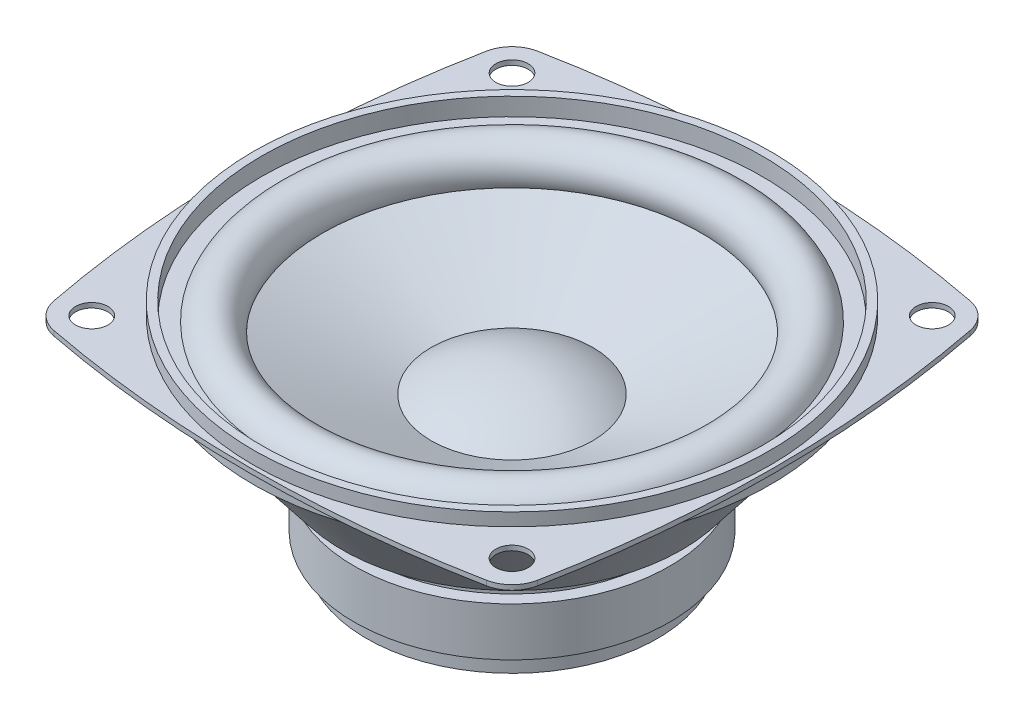
ISO-10303-21;
HEADER;
FILE_DESCRIPTION(('STEP AP214'),'2;1');
FILE_NAME('part.step','',(''),(''),'','','');
FILE_SCHEMA(('AUTOMOTIVE_DESIGN { 1 0 10303 214 1 1 1 1 }'));
ENDSEC;
DATA;
#1=APPLICATION_CONTEXT('core data for automotive mechanical design processes');
#2=APPLICATION_PROTOCOL_DEFINITION('international standard','automotive_design',2000,#1);
#3=PRODUCT_CONTEXT('',#1,'mechanical');
#4=PRODUCT('Part','Part','',(#3));
#5=PRODUCT_RELATED_PRODUCT_CATEGORY('part','',(#4));
#6=PRODUCT_DEFINITION_FORMATION('','',#4);
#7=PRODUCT_DEFINITION_CONTEXT('part definition',#1,'design');
#8=PRODUCT_DEFINITION('design','',#6,#7);
#9=PRODUCT_DEFINITION_SHAPE('','',#8);
#10=(LENGTH_UNIT() NAMED_UNIT(*) SI_UNIT(.MILLI.,.METRE.));
#11=(NAMED_UNIT(*) PLANE_ANGLE_UNIT() SI_UNIT($,.RADIAN.));
#12=(NAMED_UNIT(*) SI_UNIT($,.STERADIAN.) SOLID_ANGLE_UNIT());
#13=UNCERTAINTY_MEASURE_WITH_UNIT(LENGTH_MEASURE(1.E-05),#10,'distance_accuracy_value','');
#14=(GEOMETRIC_REPRESENTATION_CONTEXT(3) GLOBAL_UNCERTAINTY_ASSIGNED_CONTEXT((#13)) GLOBAL_UNIT_ASSIGNED_CONTEXT((#10,
#11,#12)) REPRESENTATION_CONTEXT('',''));
#15=CARTESIAN_POINT('',(0.,0.,0.));
#16=DIRECTION('',(0.,0.,1.));
#17=DIRECTION('',(1.,0.,0.));
#18=AXIS2_PLACEMENT_3D('',#15,#16,#17);
#19=CARTESIAN_POINT('',(12.5,-6.07928572530609,-29.7384862787188));
#20=DIRECTION('',(0.,0.61630826165811,0.787505001007586));
#21=DIRECTION('',(0.,-0.787505001007586,0.61630826165811));
#22=AXIS2_PLACEMENT_3D('',#19,#20,#21);
#23=PLANE('',#22);
#24=DIRECTION('',(-1.,0.,0.));
#25=VECTOR('',#24,1.);
#26=CARTESIAN_POINT('',(-8.5,-8.39726579362784,-27.9244149209017));
#27=LINE('',#26,#25);
#28=CARTESIAN_POINT('',(-12.5,-8.39726579362784,-27.9244149209017));
#29=VERTEX_POINT('',#28);
#30=CARTESIAN_POINT('',(-8.5,-8.39726579362784,-27.9244149209017));
#31=VERTEX_POINT('',#30);
#32=EDGE_CURVE('E108',#29,#31,#27,.F.);
#33=ORIENTED_EDGE('',*,*,#32,.F.);
#34=DIRECTION('',(0.,0.787505001007586,-0.61630826165811));
#35=VECTOR('',#34,1.);
#36=CARTESIAN_POINT('',(-12.5,-6.07928572530609,-29.7384862787188));
#37=LINE('',#36,#35);
#38=CARTESIAN_POINT('',(-12.5,-6.07928572530609,-29.7384862787188));
#39=VERTEX_POINT('',#38);
#40=EDGE_CURVE('E136',#29,#39,#37,.T.);
#41=ORIENTED_EDGE('',*,*,#40,.T.);
#42=DIRECTION('',(-1.,0.,0.));
#43=VECTOR('',#42,1.);
#44=CARTESIAN_POINT('',(12.5,-6.07928572530609,-29.7384862787188));
#45=LINE('',#44,#43);
#46=CARTESIAN_POINT('',(12.5,-6.07928572530609,-29.7384862787188));
#47=VERTEX_POINT('',#46);
#48=EDGE_CURVE('E162',#47,#39,#45,.T.);
#49=ORIENTED_EDGE('',*,*,#48,.F.);
#50=DIRECTION('',(0.,0.787505001007586,-0.61630826165811));
#51=VECTOR('',#50,1.);
#52=CARTESIAN_POINT('',(12.5,-6.07928572530609,-29.7384862787188));
#53=LINE('',#52,#51);
#54=CARTESIAN_POINT('',(12.5,-8.39726579362784,-27.9244149209017));
#55=VERTEX_POINT('',#54);
#56=EDGE_CURVE('E141',#55,#47,#53,.T.);
#57=ORIENTED_EDGE('',*,*,#56,.F.);
#58=DIRECTION('',(1.,0.,0.));
#59=VECTOR('',#58,1.);
#60=CARTESIAN_POINT('',(8.5,-8.39726579362784,-27.9244149209017));
#61=LINE('',#60,#59);
#62=CARTESIAN_POINT('',(8.5,-8.39726579362784,-27.9244149209017));
#63=VERTEX_POINT('',#62);
#64=EDGE_CURVE('E67',#55,#63,#61,.F.);
#65=ORIENTED_EDGE('',*,*,#64,.T.);
#66=DIRECTION('',(0.,0.787505001007586,-0.61630826165811));
#67=VECTOR('',#66,1.);
#68=CARTESIAN_POINT('',(8.5,-6.07928572530609,-29.7384862787188));
#69=LINE('',#68,#67);
#70=CARTESIAN_POINT('',(8.5,-10.061345665045,-26.6220915432709));
#71=VERTEX_POINT('',#70);
#72=EDGE_CURVE('E167',#71,#63,#69,.T.);
#73=ORIENTED_EDGE('',*,*,#72,.F.);
#74=DIRECTION('',(1.,0.,0.));
#75=VECTOR('',#74,1.);
#76=CARTESIAN_POINT('',(8.5,-10.061345665045,-26.6220915432709));
#77=LINE('',#76,#75);
#78=CARTESIAN_POINT('',(12.5,-10.061345665045,-26.6220915432709));
#79=VERTEX_POINT('',#78);
#80=EDGE_CURVE('E133',#71,#79,#77,.T.);
#81=ORIENTED_EDGE('',*,*,#80,.T.);
#82=CARTESIAN_POINT('',(12.5,-12.3793257333668,-24.8080201854539));
#83=VERTEX_POINT('',#82);
#84=EDGE_CURVE('E137',#83,#79,#53,.T.);
#85=ORIENTED_EDGE('',*,*,#84,.F.);
#86=DIRECTION('',(-1.,0.,0.));
#87=VECTOR('',#86,1.);
#88=CARTESIAN_POINT('',(12.5,-12.3793257333668,-24.8080201854539));
#89=LINE('',#88,#87);
#90=CARTESIAN_POINT('',(-12.5,-12.3793257333668,-24.8080201854539));
#91=VERTEX_POINT('',#90);
#92=EDGE_CURVE('E147',#83,#91,#89,.T.);
#93=ORIENTED_EDGE('',*,*,#92,.T.);
#94=CARTESIAN_POINT('',(-12.5,-10.061345665045,-26.6220915432709));
#95=VERTEX_POINT('',#94);
#96=EDGE_CURVE('E124',#91,#95,#37,.T.);
#97=ORIENTED_EDGE('',*,*,#96,.T.);
#98=DIRECTION('',(-1.,0.,0.));
#99=VECTOR('',#98,1.);
#100=CARTESIAN_POINT('',(-8.5,-10.061345665045,-26.6220915432709));
#101=LINE('',#100,#99);
#102=CARTESIAN_POINT('',(-8.5,-10.061345665045,-26.6220915432709));
#103=VERTEX_POINT('',#102);
#104=EDGE_CURVE('E59',#103,#95,#101,.T.);
#105=ORIENTED_EDGE('',*,*,#104,.F.);
#106=DIRECTION('',(0.,-0.787505001007586,0.61630826165811));
#107=VECTOR('',#106,1.);
#108=CARTESIAN_POINT('',(-8.5,-6.07928572530609,-29.7384862787188));
#109=LINE('',#108,#107);
#110=EDGE_CURVE('E12',#31,#103,#109,.T.);
#111=ORIENTED_EDGE('',*,*,#110,.F.);
#112=EDGE_LOOP('',(#33,#41,#49,#57,#65,#73,#81,#85,#93,#97,#105,#111));
#113=FACE_BOUND('',#112,.T.);
#114=ADVANCED_FACE('F45',(#113),#23,.F.);
#115=CARTESIAN_POINT('',(-12.5,0.,0.));
#116=DIRECTION('',(-1.,0.,0.));
#117=DIRECTION('',(0.,0.,1.));
#118=AXIS2_PLACEMENT_3D('',#115,#116,#117);
#119=PLANE('',#118);
#120=ORIENTED_EDGE('',*,*,#40,.F.);
#121=CARTESIAN_POINT('',(-12.5,-9.22930572933643,-27.2732532320863));
#122=DIRECTION('',(-1.,0.,0.));
#123=DIRECTION('',(0.,0.,1.));
#124=AXIS2_PLACEMENT_3D('',#121,#122,#123);
#125=CIRCLE('',#124,1.05655193890074);
#126=EDGE_CURVE('E52',#29,#95,#125,.F.);
#127=ORIENTED_EDGE('',*,*,#126,.T.);
#128=ORIENTED_EDGE('',*,*,#96,.F.);
#129=DIRECTION('',(0.,-0.61630826165811,-0.787505001007586));
#130=VECTOR('',#129,1.);
#131=CARTESIAN_POINT('',(-12.5,-12.3793257333668,-24.8080201854539));
#132=LINE('',#131,#130);
#133=CARTESIAN_POINT('',(-12.5,-11.1467092100506,-23.2330101834387));
#134=VERTEX_POINT('',#133);
#135=EDGE_CURVE('E153',#134,#91,#132,.T.);
#136=ORIENTED_EDGE('',*,*,#135,.F.);
#137=DIRECTION('',(0.,-0.787505001007586,0.616308261658111));
#138=VECTOR('',#137,1.);
#139=CARTESIAN_POINT('',(-12.5,-4.84666920198987,-28.1634762767036));
#140=LINE('',#139,#138);
#141=CARTESIAN_POINT('',(-12.5,-4.84666920198987,-28.1634762767036));
#142=VERTEX_POINT('',#141);
#143=EDGE_CURVE('E151',#142,#134,#140,.T.);
#144=ORIENTED_EDGE('',*,*,#143,.F.);
#145=DIRECTION('',(0.,0.616308261658111,0.787505001007585));
#146=VECTOR('',#145,1.);
#147=CARTESIAN_POINT('',(-12.5,-6.07928572530609,-29.7384862787188));
#148=LINE('',#147,#146);
#149=EDGE_CURVE('E149',#39,#142,#148,.T.);
#150=ORIENTED_EDGE('',*,*,#149,.F.);
#151=EDGE_LOOP('',(#120,#127,#128,#136,#144,#150));
#152=FACE_BOUND('',#151,.T.);
#153=ADVANCED_FACE('F169',(#152),#119,.T.);
#154=CARTESIAN_POINT('',(12.5,-6.07928572530609,-29.7384862787188));
#155=DIRECTION('',(0.,-0.787505001007586,0.616308261658111));
#156=DIRECTION('',(0.,-0.616308261658111,-0.787505001007585));
#157=AXIS2_PLACEMENT_3D('',#154,#155,#156);
#158=PLANE('',#157);
#159=ORIENTED_EDGE('',*,*,#149,.T.);
#160=DIRECTION('',(-1.,0.,0.));
#161=VECTOR('',#160,1.);
#162=CARTESIAN_POINT('',(12.5,-4.84666920198987,-28.1634762767036));
#163=LINE('',#162,#161);
#164=CARTESIAN_POINT('',(12.5,-4.84666920198987,-28.1634762767036));
#165=VERTEX_POINT('',#164);
#166=EDGE_CURVE('E159',#165,#142,#163,.T.);
#167=ORIENTED_EDGE('',*,*,#166,.F.);
#168=DIRECTION('',(0.,0.616308261658111,0.787505001007585));
#169=VECTOR('',#168,1.);
#170=CARTESIAN_POINT('',(12.5,-6.07928572530609,-29.7384862787188));
#171=LINE('',#170,#169);
#172=EDGE_CURVE('E140',#47,#165,#171,.T.);
#173=ORIENTED_EDGE('',*,*,#172,.F.);
#174=ORIENTED_EDGE('',*,*,#48,.T.);
#175=EDGE_LOOP('',(#159,#167,#173,#174));
#176=FACE_BOUND('',#175,.T.);
#177=ADVANCED_FACE('F177',(#176),#158,.F.);
#178=CARTESIAN_POINT('',(12.5,-4.84666920198987,-28.1634762767036));
#179=DIRECTION('',(0.,-0.61630826165811,-0.787505001007586));
#180=DIRECTION('',(0.,0.787505001007586,-0.616308261658111));
#181=AXIS2_PLACEMENT_3D('',#178,#179,#180);
#182=PLANE('',#181);
#183=ORIENTED_EDGE('',*,*,#143,.T.);
#184=DIRECTION('',(-1.,0.,0.));
#185=VECTOR('',#184,1.);
#186=CARTESIAN_POINT('',(12.5,-11.1467092100506,-23.2330101834387));
#187=LINE('',#186,#185);
#188=CARTESIAN_POINT('',(12.5,-11.1467092100506,-23.2330101834387));
#189=VERTEX_POINT('',#188);
#190=EDGE_CURVE('E156',#189,#134,#187,.T.);
#191=ORIENTED_EDGE('',*,*,#190,.F.);
#192=DIRECTION('',(0.,-0.787505001007586,0.616308261658111));
#193=VECTOR('',#192,1.);
#194=CARTESIAN_POINT('',(12.5,-4.84666920198987,-28.1634762767036));
#195=LINE('',#194,#193);
#196=EDGE_CURVE('E143',#165,#189,#195,.T.);
#197=ORIENTED_EDGE('',*,*,#196,.F.);
#198=ORIENTED_EDGE('',*,*,#166,.T.);
#199=EDGE_LOOP('',(#183,#191,#197,#198));
#200=FACE_BOUND('',#199,.T.);
#201=ADVANCED_FACE('F209',(#200),#182,.F.);
#202=CARTESIAN_POINT('',(12.5,-12.3793257333668,-24.8080201854539));
#203=DIRECTION('',(0.,0.787505001007587,-0.61630826165811));
#204=DIRECTION('',(0.,0.61630826165811,0.787505001007587));
#205=AXIS2_PLACEMENT_3D('',#202,#203,#204);
#206=PLANE('',#205);
#207=ORIENTED_EDGE('',*,*,#135,.T.);
#208=ORIENTED_EDGE('',*,*,#92,.F.);
#209=DIRECTION('',(0.,-0.61630826165811,-0.787505001007586));
#210=VECTOR('',#209,1.);
#211=CARTESIAN_POINT('',(12.5,-12.3793257333668,-24.8080201854539));
#212=LINE('',#211,#210);
#213=EDGE_CURVE('E145',#189,#83,#212,.T.);
#214=ORIENTED_EDGE('',*,*,#213,.F.);
#215=ORIENTED_EDGE('',*,*,#190,.T.);
#216=EDGE_LOOP('',(#207,#208,#214,#215));
#217=FACE_BOUND('',#216,.T.);
#218=ADVANCED_FACE('F198',(#217),#206,.F.);
#219=CARTESIAN_POINT('',(12.5,0.,0.));
#220=DIRECTION('',(-1.,0.,0.));
#221=DIRECTION('',(0.,0.,1.));
#222=AXIS2_PLACEMENT_3D('',#219,#220,#221);
#223=PLANE('',#222);
#224=ORIENTED_EDGE('',*,*,#84,.T.);
#225=CARTESIAN_POINT('',(12.5,-9.22930572933643,-27.2732532320863));
#226=DIRECTION('',(-1.,0.,0.));
#227=DIRECTION('',(0.,0.,1.));
#228=AXIS2_PLACEMENT_3D('',#225,#226,#227);
#229=CIRCLE('',#228,1.05655193890074);
#230=EDGE_CURVE('E165',#79,#55,#229,.T.);
#231=ORIENTED_EDGE('',*,*,#230,.T.);
#232=ORIENTED_EDGE('',*,*,#56,.T.);
#233=ORIENTED_EDGE('',*,*,#172,.T.);
#234=ORIENTED_EDGE('',*,*,#196,.T.);
#235=ORIENTED_EDGE('',*,*,#213,.T.);
#236=EDGE_LOOP('',(#224,#231,#232,#233,#234,#235));
#237=FACE_BOUND('',#236,.T.);
#238=ADVANCED_FACE('F181',(#237),#223,.F.);
#239=CARTESIAN_POINT('',(8.5,-9.22930572933643,-27.2732532320863));
#240=DIRECTION('',(1.,0.,0.));
#241=DIRECTION('',(0.,0.,-1.));
#242=AXIS2_PLACEMENT_3D('',#239,#240,#241);
#243=PLANE('',#242);
#244=CARTESIAN_POINT('',(8.5,-9.22930572933643,-27.2732532320863));
#245=DIRECTION('',(1.,0.,0.));
#246=DIRECTION('',(0.,0.,-1.));
#247=AXIS2_PLACEMENT_3D('',#244,#245,#246);
#248=CIRCLE('',#247,1.05655193890074);
#249=EDGE_CURVE('E130',#71,#63,#248,.T.);
#250=ORIENTED_EDGE('',*,*,#249,.F.);
#251=ORIENTED_EDGE('',*,*,#72,.T.);
#252=EDGE_LOOP('',(#250,#251));
#253=FACE_BOUND('',#252,.T.);
#254=ADVANCED_FACE('F188',(#253),#243,.F.);
#255=CARTESIAN_POINT('',(8.5,-9.22930572933643,-27.2732532320863));
#256=DIRECTION('',(1.,0.,0.));
#257=DIRECTION('',(0.,0.,-1.));
#258=AXIS2_PLACEMENT_3D('',#255,#256,#257);
#259=CYLINDRICAL_SURFACE('',#258,1.05655193890074);
#260=CARTESIAN_POINT('',(20.5,-9.22930572933643,-27.2732532320863));
#261=DIRECTION('',(1.,0.,0.));
#262=DIRECTION('',(0.,0.,-1.));
#263=AXIS2_PLACEMENT_3D('',#260,#261,#262);
#264=CIRCLE('',#263,1.05655193890074);
#265=CARTESIAN_POINT('',(20.5,-9.22930572933643,-28.3298051709871));
#266=VERTEX_POINT('',#265);
#267=EDGE_CURVE('E115',#266,#266,#264,.T.);
#268=ORIENTED_EDGE('',*,*,#267,.F.);
#269=EDGE_LOOP('',(#268));
#270=FACE_BOUND('',#269,.T.);
#271=ORIENTED_EDGE('',*,*,#80,.F.);
#272=ORIENTED_EDGE('',*,*,#249,.T.);
#273=ORIENTED_EDGE('',*,*,#64,.F.);
#274=ORIENTED_EDGE('',*,*,#230,.F.);
#275=EDGE_LOOP('',(#271,#272,#273,#274));
#276=FACE_BOUND('',#275,.T.);
#277=ADVANCED_FACE('F184',(#270,#276),#259,.T.);
#278=CARTESIAN_POINT('',(20.5,-9.22930572933643,-27.2732532320863));
#279=DIRECTION('',(1.,0.,0.));
#280=DIRECTION('',(0.,0.,-1.));
#281=AXIS2_PLACEMENT_3D('',#278,#279,#280);
#282=PLANE('',#281);
#283=ORIENTED_EDGE('',*,*,#267,.T.);
#284=EDGE_LOOP('',(#283));
#285=FACE_BOUND('',#284,.T.);
#286=ADVANCED_FACE('F195',(#285),#282,.T.);
#287=CARTESIAN_POINT('',(-8.5,-9.22930572933643,-27.2732532320863));
#288=DIRECTION('',(-1.,0.,0.));
#289=DIRECTION('',(0.,0.,-1.));
#290=AXIS2_PLACEMENT_3D('',#287,#288,#289);
#291=PLANE('',#290);
#292=CARTESIAN_POINT('',(-8.5,-9.22930572933643,-27.2732532320863));
#293=DIRECTION('',(1.,0.,0.));
#294=DIRECTION('',(0.,0.,-1.));
#295=AXIS2_PLACEMENT_3D('',#292,#293,#294);
#296=CIRCLE('',#295,1.05655193890074);
#297=EDGE_CURVE('E111',#103,#31,#296,.T.);
#298=ORIENTED_EDGE('',*,*,#297,.T.);
#299=ORIENTED_EDGE('',*,*,#110,.T.);
#300=EDGE_LOOP('',(#298,#299));
#301=FACE_BOUND('',#300,.T.);
#302=ADVANCED_FACE('F118',(#301),#291,.F.);
#303=CARTESIAN_POINT('',(-8.5,-9.22930572933643,-27.2732532320863));
#304=DIRECTION('',(-1.,0.,0.));
#305=DIRECTION('',(0.,0.,1.));
#306=AXIS2_PLACEMENT_3D('',#303,#304,#305);
#307=CYLINDRICAL_SURFACE('',#306,1.05655193890074);
#308=CARTESIAN_POINT('',(-20.5,-9.22930572933643,-27.2732532320863));
#309=DIRECTION('',(1.,0.,0.));
#310=DIRECTION('',(0.,0.,-1.));
#311=AXIS2_PLACEMENT_3D('',#308,#309,#310);
#312=CIRCLE('',#311,1.05655193890074);
#313=CARTESIAN_POINT('',(-20.5,-9.22930572933643,-28.3298051709871));
#314=VERTEX_POINT('',#313);
#315=EDGE_CURVE('E119',#314,#314,#312,.T.);
#316=ORIENTED_EDGE('',*,*,#315,.T.);
#317=EDGE_LOOP('',(#316));
#318=FACE_BOUND('',#317,.T.);
#319=ORIENTED_EDGE('',*,*,#126,.F.);
#320=ORIENTED_EDGE('',*,*,#32,.T.);
#321=ORIENTED_EDGE('',*,*,#297,.F.);
#322=ORIENTED_EDGE('',*,*,#104,.T.);
#323=EDGE_LOOP('',(#319,#320,#321,#322));
#324=FACE_BOUND('',#323,.T.);
#325=ADVANCED_FACE('F110',(#318,#324),#307,.T.);
#326=CARTESIAN_POINT('',(-20.5,-9.22930572933643,-27.2732532320863));
#327=DIRECTION('',(-1.,0.,0.));
#328=DIRECTION('',(0.,0.,-1.));
#329=AXIS2_PLACEMENT_3D('',#326,#327,#328);
#330=PLANE('',#329);
#331=ORIENTED_EDGE('',*,*,#315,.F.);
#332=EDGE_LOOP('',(#331));
#333=FACE_BOUND('',#332,.T.);
#334=ADVANCED_FACE('F273',(#333),#330,.T.);
#335=CLOSED_SHELL('',(#114,#153,#177,#201,#218,#238,#254,#277,#286,#302,#325,#334));
#336=MANIFOLD_SOLID_BREP('B2',#335);
#337=CARTESIAN_POINT('',(13.,0.6,40.9749999999997));
#338=DIRECTION('',(0.,-1.,0.));
#339=DIRECTION('',(0.,0.,-1.));
#340=AXIS2_PLACEMENT_3D('',#337,#338,#339);
#341=PLANE('',#340);
#342=CARTESIAN_POINT('',(26.,0.6,26.));
#343=DIRECTION('',(0.,1.,0.));
#344=DIRECTION('',(0.,0.,1.));
#345=AXIS2_PLACEMENT_3D('',#342,#343,#344);
#346=CIRCLE('',#345,2.);
#347=CARTESIAN_POINT('',(26.,0.6,28.));
#348=VERTEX_POINT('',#347);
#349=EDGE_CURVE('E459',#348,#348,#346,.T.);
#350=ORIENTED_EDGE('',*,*,#349,.F.);
#351=EDGE_LOOP('',(#350));
#352=FACE_BOUND('',#351,.T.);
#353=CARTESIAN_POINT('',(-26.,0.6,-26.));
#354=DIRECTION('',(0.,1.,0.));
#355=DIRECTION('',(0.,0.,1.));
#356=AXIS2_PLACEMENT_3D('',#353,#354,#355);
#357=CIRCLE('',#356,2.00000000000001);
#358=CARTESIAN_POINT('',(-26.,0.6,-24.));
#359=VERTEX_POINT('',#358);
#360=EDGE_CURVE('E449',#359,#359,#357,.T.);
#361=ORIENTED_EDGE('',*,*,#360,.F.);
#362=EDGE_LOOP('',(#361));
#363=FACE_BOUND('',#362,.T.);
#364=CARTESIAN_POINT('',(0.,0.6,107.949999999999));
#365=DIRECTION('',(0.,1.,0.));
#366=DIRECTION('',(0.,0.,-1.));
#367=AXIS2_PLACEMENT_3D('',#364,#365,#366);
#368=CIRCLE('',#367,140.45);
#369=CARTESIAN_POINT('',(26.7621839501649,0.6,-29.9267130817149));
#370=VERTEX_POINT('',#369);
#371=CARTESIAN_POINT('',(-26.7621839501649,0.6,-29.9267130817149));
#372=VERTEX_POINT('',#371);
#373=EDGE_CURVE('E413',#370,#372,#368,.T.);
#374=ORIENTED_EDGE('',*,*,#373,.T.);
#375=CARTESIAN_POINT('',(-26.,0.6,-26.));
#376=DIRECTION('',(0.,1.,0.));
#377=DIRECTION('',(0.,0.,1.));
#378=AXIS2_PLACEMENT_3D('',#375,#376,#377);
#379=CIRCLE('',#378,4.00000000000004);
#380=CARTESIAN_POINT('',(-29.9267130817149,0.6,-26.7621839501649));
#381=VERTEX_POINT('',#380);
#382=EDGE_CURVE('E361',#372,#381,#379,.T.);
#383=ORIENTED_EDGE('',*,*,#382,.T.);
#384=CARTESIAN_POINT('',(107.950000000002,0.6,0.));
#385=DIRECTION('',(0.,1.,0.));
#386=DIRECTION('',(0.,0.,1.));
#387=AXIS2_PLACEMENT_3D('',#384,#385,#386);
#388=CIRCLE('',#387,140.450000000002);
#389=CARTESIAN_POINT('',(-29.926713081715,0.6,26.7621839501649));
#390=VERTEX_POINT('',#389);
#391=EDGE_CURVE('E428',#381,#390,#388,.T.);
#392=ORIENTED_EDGE('',*,*,#391,.T.);
#393=CARTESIAN_POINT('',(-26.,0.6,26.));
#394=DIRECTION('',(0.,1.,0.));
#395=DIRECTION('',(0.,0.,1.));
#396=AXIS2_PLACEMENT_3D('',#393,#394,#395);
#397=CIRCLE('',#396,4.00000000000003);
#398=CARTESIAN_POINT('',(-26.7621839501649,0.6,29.9267130817149));
#399=VERTEX_POINT('',#398);
#400=EDGE_CURVE('E441',#390,#399,#397,.T.);
#401=ORIENTED_EDGE('',*,*,#400,.T.);
#402=CARTESIAN_POINT('',(0.,0.6,-107.95));
#403=DIRECTION('',(0.,1.,0.));
#404=DIRECTION('',(0.,0.,1.));
#405=AXIS2_PLACEMENT_3D('',#402,#403,#404);
#406=CIRCLE('',#405,140.45);
#407=CARTESIAN_POINT('',(26.762183950165,0.6,29.9267130817149));
#408=VERTEX_POINT('',#407);
#409=EDGE_CURVE('E380',#399,#408,#406,.T.);
#410=ORIENTED_EDGE('',*,*,#409,.T.);
#411=CARTESIAN_POINT('',(26.,0.6,26.));
#412=DIRECTION('',(0.,1.,0.));
#413=DIRECTION('',(0.,0.,1.));
#414=AXIS2_PLACEMENT_3D('',#411,#412,#413);
#415=CIRCLE('',#414,4.00000000000003);
#416=CARTESIAN_POINT('',(29.9267130817149,0.6,26.7621839501649));
#417=VERTEX_POINT('',#416);
#418=EDGE_CURVE('E374',#408,#417,#415,.T.);
#419=ORIENTED_EDGE('',*,*,#418,.T.);
#420=CARTESIAN_POINT('',(-107.950000000001,0.6,0.));
#421=DIRECTION('',(0.,1.,0.));
#422=DIRECTION('',(0.,0.,-1.));
#423=AXIS2_PLACEMENT_3D('',#420,#421,#422);
#424=CIRCLE('',#423,140.450000000001);
#425=CARTESIAN_POINT('',(29.926713081715,0.6,-26.7621839501649));
#426=VERTEX_POINT('',#425);
#427=EDGE_CURVE('E378',#417,#426,#424,.T.);
#428=ORIENTED_EDGE('',*,*,#427,.T.);
#429=CARTESIAN_POINT('',(26.,0.6,-26.));
#430=DIRECTION('',(0.,1.,0.));
#431=DIRECTION('',(0.,0.,1.));
#432=AXIS2_PLACEMENT_3D('',#429,#430,#431);
#433=CIRCLE('',#432,4.00000000000004);
#434=EDGE_CURVE('E318',#426,#370,#433,.T.);
#435=ORIENTED_EDGE('',*,*,#434,.T.);
#436=EDGE_LOOP('',(#374,#383,#392,#401,#410,#419,#428,#435));
#437=FACE_BOUND('',#436,.T.);
#438=CARTESIAN_POINT('',(0.,0.6,0.));
#439=DIRECTION('',(0.,1.,0.));
#440=DIRECTION('',(0.,0.,1.));
#441=AXIS2_PLACEMENT_3D('',#438,#439,#440);
#442=CIRCLE('',#441,32.);
#443=CARTESIAN_POINT('',(0.,0.6,32.));
#444=VERTEX_POINT('',#443);
#445=EDGE_CURVE('E402',#444,#444,#442,.T.);
#446=ORIENTED_EDGE('',*,*,#445,.F.);
#447=EDGE_LOOP('',(#446));
#448=FACE_BOUND('',#447,.T.);
#449=CARTESIAN_POINT('',(26.,0.6,-26.));
#450=DIRECTION('',(0.,1.,0.));
#451=DIRECTION('',(0.,0.,1.));
#452=AXIS2_PLACEMENT_3D('',#449,#450,#451);
#453=CIRCLE('',#452,2.);
#454=CARTESIAN_POINT('',(26.,0.6,-24.));
#455=VERTEX_POINT('',#454);
#456=EDGE_CURVE('E453',#455,#455,#453,.T.);
#457=ORIENTED_EDGE('',*,*,#456,.F.);
#458=EDGE_LOOP('',(#457));
#459=FACE_BOUND('',#458,.T.);
#460=CARTESIAN_POINT('',(-26.,0.6,26.));
#461=DIRECTION('',(0.,1.,0.));
#462=DIRECTION('',(0.,0.,1.));
#463=AXIS2_PLACEMENT_3D('',#460,#461,#462);
#464=CIRCLE('',#463,2.00000000000001);
#465=CARTESIAN_POINT('',(-26.,0.6,28.));
#466=VERTEX_POINT('',#465);
#467=EDGE_CURVE('E465',#466,#466,#464,.T.);
#468=ORIENTED_EDGE('',*,*,#467,.F.);
#469=EDGE_LOOP('',(#468));
#470=FACE_BOUND('',#469,.T.);
#471=ADVANCED_FACE('F301',(#352,#363,#437,#448,#459,#470),#341,.F.);
#472=CARTESIAN_POINT('',(13.,0.,40.9749999999997));
#473=DIRECTION('',(0.,-1.,0.));
#474=DIRECTION('',(0.,0.,-1.));
#475=AXIS2_PLACEMENT_3D('',#472,#473,#474);
#476=PLANE('',#475);
#477=CARTESIAN_POINT('',(26.,0.,26.));
#478=DIRECTION('',(0.,1.,0.));
#479=DIRECTION('',(0.,0.,1.));
#480=AXIS2_PLACEMENT_3D('',#477,#478,#479);
#481=CIRCLE('',#480,2.);
#482=CARTESIAN_POINT('',(26.,0.,28.));
#483=VERTEX_POINT('',#482);
#484=EDGE_CURVE('E462',#483,#483,#481,.T.);
#485=ORIENTED_EDGE('',*,*,#484,.T.);
#486=EDGE_LOOP('',(#485));
#487=FACE_BOUND('',#486,.T.);
#488=CARTESIAN_POINT('',(-26.,0.,-26.));
#489=DIRECTION('',(0.,1.,0.));
#490=DIRECTION('',(0.,0.,1.));
#491=AXIS2_PLACEMENT_3D('',#488,#489,#490);
#492=CIRCLE('',#491,2.00000000000001);
#493=CARTESIAN_POINT('',(-26.,0.,-24.));
#494=VERTEX_POINT('',#493);
#495=EDGE_CURVE('E450',#494,#494,#492,.T.);
#496=ORIENTED_EDGE('',*,*,#495,.T.);
#497=EDGE_LOOP('',(#496));
#498=FACE_BOUND('',#497,.T.);
#499=CARTESIAN_POINT('',(0.,0.,107.949999999999));
#500=DIRECTION('',(0.,1.,0.));
#501=DIRECTION('',(0.,0.,-1.));
#502=AXIS2_PLACEMENT_3D('',#499,#500,#501);
#503=CIRCLE('',#502,140.45);
#504=CARTESIAN_POINT('',(26.7621839501649,0.,-29.9267130817149));
#505=VERTEX_POINT('',#504);
#506=CARTESIAN_POINT('',(-26.7621839501649,0.,-29.9267130817149));
#507=VERTEX_POINT('',#506);
#508=EDGE_CURVE('E398',#505,#507,#503,.T.);
#509=ORIENTED_EDGE('',*,*,#508,.F.);
#510=CARTESIAN_POINT('',(26.,0.,-26.));
#511=DIRECTION('',(0.,1.,0.));
#512=DIRECTION('',(0.,0.,1.));
#513=AXIS2_PLACEMENT_3D('',#510,#511,#512);
#514=CIRCLE('',#513,4.00000000000004);
#515=CARTESIAN_POINT('',(29.926713081715,0.,-26.7621839501649));
#516=VERTEX_POINT('',#515);
#517=EDGE_CURVE('E353',#516,#505,#514,.T.);
#518=ORIENTED_EDGE('',*,*,#517,.F.);
#519=CARTESIAN_POINT('',(-107.950000000001,0.,0.));
#520=DIRECTION('',(0.,1.,0.));
#521=DIRECTION('',(0.,0.,-1.));
#522=AXIS2_PLACEMENT_3D('',#519,#520,#521);
#523=CIRCLE('',#522,140.450000000001);
#524=CARTESIAN_POINT('',(29.9267130817149,0.,26.7621839501649));
#525=VERTEX_POINT('',#524);
#526=EDGE_CURVE('E347',#525,#516,#523,.T.);
#527=ORIENTED_EDGE('',*,*,#526,.F.);
#528=CARTESIAN_POINT('',(26.,0.,26.));
#529=DIRECTION('',(0.,1.,0.));
#530=DIRECTION('',(0.,0.,1.));
#531=AXIS2_PLACEMENT_3D('',#528,#529,#530);
#532=CIRCLE('',#531,4.00000000000003);
#533=CARTESIAN_POINT('',(26.762183950165,0.,29.9267130817149));
#534=VERTEX_POINT('',#533);
#535=EDGE_CURVE('E388',#534,#525,#532,.T.);
#536=ORIENTED_EDGE('',*,*,#535,.F.);
#537=CARTESIAN_POINT('',(0.,0.,-107.95));
#538=DIRECTION('',(0.,1.,0.));
#539=DIRECTION('',(0.,0.,1.));
#540=AXIS2_PLACEMENT_3D('',#537,#538,#539);
#541=CIRCLE('',#540,140.45);
#542=CARTESIAN_POINT('',(-26.7621839501649,0.,29.9267130817149));
#543=VERTEX_POINT('',#542);
#544=EDGE_CURVE('E408',#543,#534,#541,.T.);
#545=ORIENTED_EDGE('',*,*,#544,.F.);
#546=CARTESIAN_POINT('',(-26.,0.,26.));
#547=DIRECTION('',(0.,1.,0.));
#548=DIRECTION('',(0.,0.,1.));
#549=AXIS2_PLACEMENT_3D('',#546,#547,#548);
#550=CIRCLE('',#549,4.00000000000003);
#551=CARTESIAN_POINT('',(-29.926713081715,0.,26.7621839501649));
#552=VERTEX_POINT('',#551);
#553=EDGE_CURVE('E406',#552,#543,#550,.T.);
#554=ORIENTED_EDGE('',*,*,#553,.F.);
#555=CARTESIAN_POINT('',(107.950000000002,0.,0.));
#556=DIRECTION('',(0.,1.,0.));
#557=DIRECTION('',(0.,0.,1.));
#558=AXIS2_PLACEMENT_3D('',#555,#556,#557);
#559=CIRCLE('',#558,140.450000000002);
#560=CARTESIAN_POINT('',(-29.9267130817149,0.,-26.7621839501649));
#561=VERTEX_POINT('',#560);
#562=EDGE_CURVE('E404',#561,#552,#559,.T.);
#563=ORIENTED_EDGE('',*,*,#562,.F.);
#564=CARTESIAN_POINT('',(-26.,0.,-26.));
#565=DIRECTION('',(0.,1.,0.));
#566=DIRECTION('',(0.,0.,1.));
#567=AXIS2_PLACEMENT_3D('',#564,#565,#566);
#568=CIRCLE('',#567,4.00000000000004);
#569=EDGE_CURVE('E401',#507,#561,#568,.T.);
#570=ORIENTED_EDGE('',*,*,#569,.F.);
#571=EDGE_LOOP('',(#509,#518,#527,#536,#545,#554,#563,#570));
#572=FACE_BOUND('',#571,.T.);
#573=CARTESIAN_POINT('',(0.,0.,0.));
#574=DIRECTION('',(0.,-1.,0.));
#575=DIRECTION('',(0.,0.,-1.));
#576=AXIS2_PLACEMENT_3D('',#573,#574,#575);
#577=CIRCLE('',#576,32.);
#578=CARTESIAN_POINT('',(0.,0.,-32.));
#579=VERTEX_POINT('',#578);
#580=EDGE_CURVE('E471',#579,#579,#577,.F.);
#581=ORIENTED_EDGE('',*,*,#580,.T.);
#582=EDGE_LOOP('',(#581));
#583=FACE_BOUND('',#582,.T.);
#584=CARTESIAN_POINT('',(26.,0.,-26.));
#585=DIRECTION('',(0.,1.,0.));
#586=DIRECTION('',(0.,0.,1.));
#587=AXIS2_PLACEMENT_3D('',#584,#585,#586);
#588=CIRCLE('',#587,2.);
#589=CARTESIAN_POINT('',(26.,0.,-24.));
#590=VERTEX_POINT('',#589);
#591=EDGE_CURVE('E456',#590,#590,#588,.T.);
#592=ORIENTED_EDGE('',*,*,#591,.T.);
#593=EDGE_LOOP('',(#592));
#594=FACE_BOUND('',#593,.T.);
#595=CARTESIAN_POINT('',(-26.,0.,26.));
#596=DIRECTION('',(0.,1.,0.));
#597=DIRECTION('',(0.,0.,1.));
#598=AXIS2_PLACEMENT_3D('',#595,#596,#597);
#599=CIRCLE('',#598,2.00000000000001);
#600=CARTESIAN_POINT('',(-26.,0.,28.));
#601=VERTEX_POINT('',#600);
#602=EDGE_CURVE('E468',#601,#601,#599,.T.);
#603=ORIENTED_EDGE('',*,*,#602,.T.);
#604=EDGE_LOOP('',(#603));
#605=FACE_BOUND('',#604,.T.);
#606=ADVANCED_FACE('F432',(#487,#498,#572,#583,#594,#605),#476,.T.);
#607=CARTESIAN_POINT('',(0.,0.6,107.949999999999));
#608=DIRECTION('',(0.,-1.,0.));
#609=DIRECTION('',(0.,0.,-1.));
#610=AXIS2_PLACEMENT_3D('',#607,#608,#609);
#611=CYLINDRICAL_SURFACE('',#610,140.45);
#612=ORIENTED_EDGE('',*,*,#508,.T.);
#613=DIRECTION('',(0.,-1.,0.));
#614=VECTOR('',#613,1.);
#615=CARTESIAN_POINT('',(-26.7621839501649,0.6,-29.9267130817149));
#616=LINE('',#615,#614);
#617=EDGE_CURVE('E43',#372,#507,#616,.T.);
#618=ORIENTED_EDGE('',*,*,#617,.F.);
#619=ORIENTED_EDGE('',*,*,#373,.F.);
#620=DIRECTION('',(0.,-1.,0.));
#621=VECTOR('',#620,1.);
#622=CARTESIAN_POINT('',(26.7621839501649,0.6,-29.9267130817149));
#623=LINE('',#622,#621);
#624=EDGE_CURVE('E394',#370,#505,#623,.T.);
#625=ORIENTED_EDGE('',*,*,#624,.T.);
#626=EDGE_LOOP('',(#612,#618,#619,#625));
#627=FACE_BOUND('',#626,.T.);
#628=ADVANCED_FACE('F303',(#627),#611,.T.);
#629=CARTESIAN_POINT('',(-26.,0.6,-26.));
#630=DIRECTION('',(0.,-1.,0.));
#631=DIRECTION('',(0.,0.,-1.));
#632=AXIS2_PLACEMENT_3D('',#629,#630,#631);
#633=CYLINDRICAL_SURFACE('',#632,4.00000000000004);
#634=ORIENTED_EDGE('',*,*,#569,.T.);
#635=DIRECTION('',(0.,-1.,0.));
#636=VECTOR('',#635,1.);
#637=CARTESIAN_POINT('',(-29.9267130817149,0.6,-26.7621839501649));
#638=LINE('',#637,#636);
#639=EDGE_CURVE('E310',#381,#561,#638,.T.);
#640=ORIENTED_EDGE('',*,*,#639,.F.);
#641=ORIENTED_EDGE('',*,*,#382,.F.);
#642=ORIENTED_EDGE('',*,*,#617,.T.);
#643=EDGE_LOOP('',(#634,#640,#641,#642));
#644=FACE_BOUND('',#643,.T.);
#645=ADVANCED_FACE('F618',(#644),#633,.T.);
#646=CARTESIAN_POINT('',(107.950000000002,0.6,0.));
#647=DIRECTION('',(0.,-1.,0.));
#648=DIRECTION('',(0.,0.,-1.));
#649=AXIS2_PLACEMENT_3D('',#646,#647,#648);
#650=CYLINDRICAL_SURFACE('',#649,140.450000000002);
#651=ORIENTED_EDGE('',*,*,#562,.T.);
#652=DIRECTION('',(0.,-1.,0.));
#653=VECTOR('',#652,1.);
#654=CARTESIAN_POINT('',(-29.926713081715,0.6,26.7621839501649));
#655=LINE('',#654,#653);
#656=EDGE_CURVE('E420',#390,#552,#655,.T.);
#657=ORIENTED_EDGE('',*,*,#656,.F.);
#658=ORIENTED_EDGE('',*,*,#391,.F.);
#659=ORIENTED_EDGE('',*,*,#639,.T.);
#660=EDGE_LOOP('',(#651,#657,#658,#659));
#661=FACE_BOUND('',#660,.T.);
#662=ADVANCED_FACE('F426',(#661),#650,.T.);
#663=CARTESIAN_POINT('',(-26.,0.6,26.));
#664=DIRECTION('',(0.,-1.,0.));
#665=DIRECTION('',(0.,0.,-1.));
#666=AXIS2_PLACEMENT_3D('',#663,#664,#665);
#667=CYLINDRICAL_SURFACE('',#666,4.00000000000003);
#668=ORIENTED_EDGE('',*,*,#553,.T.);
#669=DIRECTION('',(0.,-1.,0.));
#670=VECTOR('',#669,1.);
#671=CARTESIAN_POINT('',(-26.7621839501649,0.6,29.9267130817149));
#672=LINE('',#671,#670);
#673=EDGE_CURVE('E417',#399,#543,#672,.T.);
#674=ORIENTED_EDGE('',*,*,#673,.F.);
#675=ORIENTED_EDGE('',*,*,#400,.F.);
#676=ORIENTED_EDGE('',*,*,#656,.T.);
#677=EDGE_LOOP('',(#668,#674,#675,#676));
#678=FACE_BOUND('',#677,.T.);
#679=ADVANCED_FACE('F437',(#678),#667,.T.);
#680=CARTESIAN_POINT('',(0.,0.6,-107.95));
#681=DIRECTION('',(0.,-1.,0.));
#682=DIRECTION('',(0.,0.,-1.));
#683=AXIS2_PLACEMENT_3D('',#680,#681,#682);
#684=CYLINDRICAL_SURFACE('',#683,140.45);
#685=ORIENTED_EDGE('',*,*,#544,.T.);
#686=DIRECTION('',(0.,-1.,0.));
#687=VECTOR('',#686,1.);
#688=CARTESIAN_POINT('',(26.762183950165,0.6,29.9267130817149));
#689=LINE('',#688,#687);
#690=EDGE_CURVE('E389',#408,#534,#689,.T.);
#691=ORIENTED_EDGE('',*,*,#690,.F.);
#692=ORIENTED_EDGE('',*,*,#409,.F.);
#693=ORIENTED_EDGE('',*,*,#673,.T.);
#694=EDGE_LOOP('',(#685,#691,#692,#693));
#695=FACE_BOUND('',#694,.T.);
#696=ADVANCED_FACE('F440',(#695),#684,.T.);
#697=CARTESIAN_POINT('',(26.,0.6,26.));
#698=DIRECTION('',(0.,-1.,0.));
#699=DIRECTION('',(0.,0.,-1.));
#700=AXIS2_PLACEMENT_3D('',#697,#698,#699);
#701=CYLINDRICAL_SURFACE('',#700,4.00000000000003);
#702=ORIENTED_EDGE('',*,*,#535,.T.);
#703=DIRECTION('',(0.,-1.,0.));
#704=VECTOR('',#703,1.);
#705=CARTESIAN_POINT('',(29.9267130817149,0.6,26.7621839501649));
#706=LINE('',#705,#704);
#707=EDGE_CURVE('E385',#417,#525,#706,.T.);
#708=ORIENTED_EDGE('',*,*,#707,.F.);
#709=ORIENTED_EDGE('',*,*,#418,.F.);
#710=ORIENTED_EDGE('',*,*,#690,.T.);
#711=EDGE_LOOP('',(#702,#708,#709,#710));
#712=FACE_BOUND('',#711,.T.);
#713=ADVANCED_FACE('F386',(#712),#701,.T.);
#714=CARTESIAN_POINT('',(-107.950000000001,0.6,0.));
#715=DIRECTION('',(0.,-1.,0.));
#716=DIRECTION('',(0.,0.,-1.));
#717=AXIS2_PLACEMENT_3D('',#714,#715,#716);
#718=CYLINDRICAL_SURFACE('',#717,140.450000000001);
#719=ORIENTED_EDGE('',*,*,#526,.T.);
#720=DIRECTION('',(0.,-1.,0.));
#721=VECTOR('',#720,1.);
#722=CARTESIAN_POINT('',(29.926713081715,0.6,-26.7621839501649));
#723=LINE('',#722,#721);
#724=EDGE_CURVE('E390',#426,#516,#723,.T.);
#725=ORIENTED_EDGE('',*,*,#724,.F.);
#726=ORIENTED_EDGE('',*,*,#427,.F.);
#727=ORIENTED_EDGE('',*,*,#707,.T.);
#728=EDGE_LOOP('',(#719,#725,#726,#727));
#729=FACE_BOUND('',#728,.T.);
#730=ADVANCED_FACE('F392',(#729),#718,.T.);
#731=CARTESIAN_POINT('',(26.,0.6,-26.));
#732=DIRECTION('',(0.,-1.,0.));
#733=DIRECTION('',(0.,0.,-1.));
#734=AXIS2_PLACEMENT_3D('',#731,#732,#733);
#735=CYLINDRICAL_SURFACE('',#734,4.00000000000004);
#736=ORIENTED_EDGE('',*,*,#517,.T.);
#737=ORIENTED_EDGE('',*,*,#624,.F.);
#738=ORIENTED_EDGE('',*,*,#434,.F.);
#739=ORIENTED_EDGE('',*,*,#724,.T.);
#740=EDGE_LOOP('',(#736,#737,#738,#739));
#741=FACE_BOUND('',#740,.T.);
#742=ADVANCED_FACE('F606',(#741),#735,.T.);
#743=CARTESIAN_POINT('',(-26.,0.6,-26.));
#744=DIRECTION('',(0.,-1.,0.));
#745=DIRECTION('',(0.,0.,-1.));
#746=AXIS2_PLACEMENT_3D('',#743,#744,#745);
#747=CYLINDRICAL_SURFACE('',#746,2.00000000000001);
#748=ORIENTED_EDGE('',*,*,#360,.T.);
#749=EDGE_LOOP('',(#748));
#750=FACE_BOUND('',#749,.T.);
#751=ORIENTED_EDGE('',*,*,#495,.F.);
#752=EDGE_LOOP('',(#751));
#753=FACE_BOUND('',#752,.T.);
#754=ADVANCED_FACE('F603',(#750,#753),#747,.F.);
#755=CARTESIAN_POINT('',(26.,0.6,-26.));
#756=DIRECTION('',(0.,-1.,0.));
#757=DIRECTION('',(0.,0.,-1.));
#758=AXIS2_PLACEMENT_3D('',#755,#756,#757);
#759=CYLINDRICAL_SURFACE('',#758,2.);
#760=ORIENTED_EDGE('',*,*,#456,.T.);
#761=EDGE_LOOP('',(#760));
#762=FACE_BOUND('',#761,.T.);
#763=ORIENTED_EDGE('',*,*,#591,.F.);
#764=EDGE_LOOP('',(#763));
#765=FACE_BOUND('',#764,.T.);
#766=ADVANCED_FACE('F682',(#762,#765),#759,.F.);
#767=CARTESIAN_POINT('',(26.,0.6,26.));
#768=DIRECTION('',(0.,-1.,0.));
#769=DIRECTION('',(0.,0.,-1.));
#770=AXIS2_PLACEMENT_3D('',#767,#768,#769);
#771=CYLINDRICAL_SURFACE('',#770,2.);
#772=ORIENTED_EDGE('',*,*,#349,.T.);
#773=EDGE_LOOP('',(#772));
#774=FACE_BOUND('',#773,.T.);
#775=ORIENTED_EDGE('',*,*,#484,.F.);
#776=EDGE_LOOP('',(#775));
#777=FACE_BOUND('',#776,.T.);
#778=ADVANCED_FACE('F690',(#774,#777),#771,.F.);
#779=CARTESIAN_POINT('',(-26.,0.6,26.));
#780=DIRECTION('',(0.,-1.,0.));
#781=DIRECTION('',(0.,0.,-1.));
#782=AXIS2_PLACEMENT_3D('',#779,#780,#781);
#783=CYLINDRICAL_SURFACE('',#782,2.00000000000001);
#784=ORIENTED_EDGE('',*,*,#467,.T.);
#785=EDGE_LOOP('',(#784));
#786=FACE_BOUND('',#785,.T.);
#787=ORIENTED_EDGE('',*,*,#602,.F.);
#788=EDGE_LOOP('',(#787));
#789=FACE_BOUND('',#788,.T.);
#790=ADVANCED_FACE('F588',(#786,#789),#783,.F.);
#791=CARTESIAN_POINT('',(0.,-17.4795612094556,0.));
#792=DIRECTION('',(0.,1.,0.));
#793=DIRECTION('',(-1.,0.,0.));
#794=AXIS2_PLACEMENT_3D('',#791,#792,#793);
#795=CYLINDRICAL_SURFACE('',#794,32.);
#796=ORIENTED_EDGE('',*,*,#580,.F.);
#797=EDGE_LOOP('',(#796));
#798=FACE_BOUND('',#797,.T.);
#799=CARTESIAN_POINT('',(0.,-1.5,0.));
#800=DIRECTION('',(0.,1.,0.));
#801=DIRECTION('',(-1.,0.,0.));
#802=AXIS2_PLACEMENT_3D('',#799,#800,#801);
#803=CIRCLE('',#802,32.);
#804=CARTESIAN_POINT('',(-32.,-1.50000000000001,0.));
#805=VERTEX_POINT('',#804);
#806=EDGE_CURVE('E521',#805,#805,#803,.T.);
#807=ORIENTED_EDGE('',*,*,#806,.T.);
#808=EDGE_LOOP('',(#807));
#809=FACE_BOUND('',#808,.T.);
#810=ADVANCED_FACE('F525',(#798,#809),#795,.T.);
#811=CARTESIAN_POINT('',(18.,-25.,0.));
#812=DIRECTION('',(0.,1.,0.));
#813=DIRECTION('',(-1.,0.,0.));
#814=AXIS2_PLACEMENT_3D('',#811,#812,#813);
#815=PLANE('',#814);
#816=CARTESIAN_POINT('',(0.,-25.,0.));
#817=DIRECTION('',(0.,1.,0.));
#818=DIRECTION('',(-1.,0.,0.));
#819=AXIS2_PLACEMENT_3D('',#816,#817,#818);
#820=CIRCLE('',#819,18.);
#821=CARTESIAN_POINT('',(-18.,-25.,0.));
#822=VERTEX_POINT('',#821);
#823=EDGE_CURVE('E500',#822,#822,#820,.T.);
#824=ORIENTED_EDGE('',*,*,#823,.F.);
#825=EDGE_LOOP('',(#824));
#826=FACE_BOUND('',#825,.T.);
#827=ADVANCED_FACE('F579',(#826),#815,.F.);
#828=CARTESIAN_POINT('',(0.,-17.4795612094556,0.));
#829=DIRECTION('',(0.,1.,0.));
#830=DIRECTION('',(-1.,0.,0.));
#831=AXIS2_PLACEMENT_3D('',#828,#829,#830);
#832=CYLINDRICAL_SURFACE('',#831,18.);
#833=CARTESIAN_POINT('',(0.,-22.5,0.));
#834=DIRECTION('',(0.,1.,0.));
#835=DIRECTION('',(-1.,0.,0.));
#836=AXIS2_PLACEMENT_3D('',#833,#834,#835);
#837=CIRCLE('',#836,18.);
#838=CARTESIAN_POINT('',(-18.,-22.5,0.));
#839=VERTEX_POINT('',#838);
#840=EDGE_CURVE('E497',#839,#839,#837,.T.);
#841=ORIENTED_EDGE('',*,*,#840,.F.);
#842=EDGE_LOOP('',(#841));
#843=FACE_BOUND('',#842,.T.);
#844=ORIENTED_EDGE('',*,*,#823,.T.);
#845=EDGE_LOOP('',(#844));
#846=FACE_BOUND('',#845,.T.);
#847=ADVANCED_FACE('F573',(#843,#846),#832,.T.);
#848=CARTESIAN_POINT('',(19.5,-22.5,0.));
#849=DIRECTION('',(0.,1.,0.));
#850=DIRECTION('',(-1.,0.,0.));
#851=AXIS2_PLACEMENT_3D('',#848,#849,#850);
#852=PLANE('',#851);
#853=CARTESIAN_POINT('',(0.,-22.5,0.));
#854=DIRECTION('',(0.,1.,0.));
#855=DIRECTION('',(-1.,0.,0.));
#856=AXIS2_PLACEMENT_3D('',#853,#854,#855);
#857=CIRCLE('',#856,19.5);
#858=CARTESIAN_POINT('',(-19.5,-22.5,0.));
#859=VERTEX_POINT('',#858);
#860=EDGE_CURVE('E494',#859,#859,#857,.T.);
#861=ORIENTED_EDGE('',*,*,#860,.F.);
#862=EDGE_LOOP('',(#861));
#863=FACE_BOUND('',#862,.T.);
#864=ORIENTED_EDGE('',*,*,#840,.T.);
#865=EDGE_LOOP('',(#864));
#866=FACE_BOUND('',#865,.T.);
#867=ADVANCED_FACE('F567',(#863,#866),#852,.F.);
#868=CARTESIAN_POINT('',(0.,-17.4795612094556,0.));
#869=DIRECTION('',(0.,1.,0.));
#870=DIRECTION('',(-1.,0.,0.));
#871=AXIS2_PLACEMENT_3D('',#868,#869,#870);
#872=CYLINDRICAL_SURFACE('',#871,19.5);
#873=CARTESIAN_POINT('',(0.,-16.5,0.));
#874=DIRECTION('',(0.,1.,0.));
#875=DIRECTION('',(-1.,0.,0.));
#876=AXIS2_PLACEMENT_3D('',#873,#874,#875);
#877=CIRCLE('',#876,19.5);
#878=CARTESIAN_POINT('',(-19.5,-16.5,0.));
#879=VERTEX_POINT('',#878);
#880=EDGE_CURVE('E491',#879,#879,#877,.T.);
#881=ORIENTED_EDGE('',*,*,#880,.F.);
#882=EDGE_LOOP('',(#881));
#883=FACE_BOUND('',#882,.T.);
#884=ORIENTED_EDGE('',*,*,#860,.T.);
#885=EDGE_LOOP('',(#884));
#886=FACE_BOUND('',#885,.T.);
#887=ADVANCED_FACE('F561',(#883,#886),#872,.T.);
#888=CARTESIAN_POINT('',(18.,-16.5,0.));
#889=DIRECTION('',(0.,-1.,0.));
#890=DIRECTION('',(1.,0.,0.));
#891=AXIS2_PLACEMENT_3D('',#888,#889,#890);
#892=PLANE('',#891);
#893=CARTESIAN_POINT('',(0.,-16.5,0.));
#894=DIRECTION('',(0.,1.,0.));
#895=DIRECTION('',(-1.,0.,0.));
#896=AXIS2_PLACEMENT_3D('',#893,#894,#895);
#897=CIRCLE('',#896,18.);
#898=CARTESIAN_POINT('',(-18.,-16.5,0.));
#899=VERTEX_POINT('',#898);
#900=EDGE_CURVE('E488',#899,#899,#897,.T.);
#901=ORIENTED_EDGE('',*,*,#900,.F.);
#902=EDGE_LOOP('',(#901));
#903=FACE_BOUND('',#902,.T.);
#904=ORIENTED_EDGE('',*,*,#880,.T.);
#905=EDGE_LOOP('',(#904));
#906=FACE_BOUND('',#905,.T.);
#907=ADVANCED_FACE('F555',(#903,#906),#892,.F.);
#908=CARTESIAN_POINT('',(0.,-17.4795612094556,0.));
#909=DIRECTION('',(0.,1.,0.));
#910=DIRECTION('',(-1.,0.,0.));
#911=AXIS2_PLACEMENT_3D('',#908,#909,#910);
#912=CYLINDRICAL_SURFACE('',#911,18.);
#913=CARTESIAN_POINT('',(0.,-14.,0.));
#914=DIRECTION('',(0.,1.,0.));
#915=DIRECTION('',(-1.,0.,0.));
#916=AXIS2_PLACEMENT_3D('',#913,#914,#915);
#917=CIRCLE('',#916,18.);
#918=CARTESIAN_POINT('',(-18.,-14.,0.));
#919=VERTEX_POINT('',#918);
#920=EDGE_CURVE('E485',#919,#919,#917,.T.);
#921=ORIENTED_EDGE('',*,*,#920,.F.);
#922=EDGE_LOOP('',(#921));
#923=FACE_BOUND('',#922,.T.);
#924=ORIENTED_EDGE('',*,*,#900,.T.);
#925=EDGE_LOOP('',(#924));
#926=FACE_BOUND('',#925,.T.);
#927=ADVANCED_FACE('F549',(#923,#926),#912,.T.);
#928=CARTESIAN_POINT('',(21.,-14.,0.));
#929=DIRECTION('',(0.,1.,0.));
#930=DIRECTION('',(-1.,0.,0.));
#931=AXIS2_PLACEMENT_3D('',#928,#929,#930);
#932=PLANE('',#931);
#933=CARTESIAN_POINT('',(0.,-14.,0.));
#934=DIRECTION('',(0.,1.,0.));
#935=DIRECTION('',(-1.,0.,0.));
#936=AXIS2_PLACEMENT_3D('',#933,#934,#935);
#937=CIRCLE('',#936,21.);
#938=CARTESIAN_POINT('',(-21.,-14.,0.));
#939=VERTEX_POINT('',#938);
#940=EDGE_CURVE('E482',#939,#939,#937,.T.);
#941=ORIENTED_EDGE('',*,*,#940,.F.);
#942=EDGE_LOOP('',(#941));
#943=FACE_BOUND('',#942,.T.);
#944=ORIENTED_EDGE('',*,*,#920,.T.);
#945=EDGE_LOOP('',(#944));
#946=FACE_BOUND('',#945,.T.);
#947=ADVANCED_FACE('F543',(#943,#946),#932,.F.);
#948=CARTESIAN_POINT('',(0.,-14.,0.));
#949=DIRECTION('',(0.,1.,0.));
#950=DIRECTION('',(-1.,0.,0.));
#951=AXIS2_PLACEMENT_3D('',#948,#949,#950);
#952=CONICAL_SURFACE('',#951,21.,0.664046162826684);
#953=CARTESIAN_POINT('',(0.,-2.5,0.));
#954=DIRECTION('',(0.,1.,0.));
#955=DIRECTION('',(-1.,0.,0.));
#956=AXIS2_PLACEMENT_3D('',#953,#954,#955);
#957=CIRCLE('',#956,30.);
#958=CARTESIAN_POINT('',(-30.,-2.50000000000001,0.));
#959=VERTEX_POINT('',#958);
#960=EDGE_CURVE('E479',#959,#959,#957,.T.);
#961=ORIENTED_EDGE('',*,*,#960,.F.);
#962=EDGE_LOOP('',(#961));
#963=FACE_BOUND('',#962,.T.);
#964=ORIENTED_EDGE('',*,*,#940,.T.);
#965=EDGE_LOOP('',(#964));
#966=FACE_BOUND('',#965,.T.);
#967=ADVANCED_FACE('F537',(#963,#966),#952,.T.);
#968=CARTESIAN_POINT('',(0.,-17.4795612094556,0.));
#969=DIRECTION('',(0.,1.,0.));
#970=DIRECTION('',(-1.,0.,0.));
#971=AXIS2_PLACEMENT_3D('',#968,#969,#970);
#972=CYLINDRICAL_SURFACE('',#971,30.);
#973=CARTESIAN_POINT('',(0.,-1.5,0.));
#974=DIRECTION('',(0.,1.,0.));
#975=DIRECTION('',(-1.,0.,0.));
#976=AXIS2_PLACEMENT_3D('',#973,#974,#975);
#977=CIRCLE('',#976,30.);
#978=CARTESIAN_POINT('',(-30.,-1.50000000000001,0.));
#979=VERTEX_POINT('',#978);
#980=EDGE_CURVE('E476',#979,#979,#977,.T.);
#981=ORIENTED_EDGE('',*,*,#980,.F.);
#982=EDGE_LOOP('',(#981));
#983=FACE_BOUND('',#982,.T.);
#984=ORIENTED_EDGE('',*,*,#960,.T.);
#985=EDGE_LOOP('',(#984));
#986=FACE_BOUND('',#985,.T.);
#987=ADVANCED_FACE('F531',(#983,#986),#972,.T.);
#988=CARTESIAN_POINT('',(32.,-1.5,0.));
#989=DIRECTION('',(0.,1.,0.));
#990=DIRECTION('',(-1.,0.,0.));
#991=AXIS2_PLACEMENT_3D('',#988,#989,#990);
#992=PLANE('',#991);
#993=ORIENTED_EDGE('',*,*,#806,.F.);
#994=EDGE_LOOP('',(#993));
#995=FACE_BOUND('',#994,.T.);
#996=ORIENTED_EDGE('',*,*,#980,.T.);
#997=EDGE_LOOP('',(#996));
#998=FACE_BOUND('',#997,.T.);
#999=ADVANCED_FACE('F527',(#995,#998),#992,.F.);
#1000=CARTESIAN_POINT('',(0.,2.2,0.));
#1001=DIRECTION('',(0.,1.,0.));
#1002=DIRECTION('',(-1.,0.,0.));
#1003=AXIS2_PLACEMENT_3D('',#1000,#1001,#1002);
#1004=CIRCLE('',#1003,32.);
#1005=CARTESIAN_POINT('',(-32.,2.19999999999999,0.));
#1006=VERTEX_POINT('',#1005);
#1007=EDGE_CURVE('E518',#1006,#1006,#1004,.T.);
#1008=ORIENTED_EDGE('',*,*,#1007,.F.);
#1009=EDGE_LOOP('',(#1008));
#1010=FACE_BOUND('',#1009,.T.);
#1011=ORIENTED_EDGE('',*,*,#445,.T.);
#1012=EDGE_LOOP('',(#1011));
#1013=FACE_BOUND('',#1012,.T.);
#1014=ADVANCED_FACE('F530',(#1010,#1013),#795,.T.);
#1015=CARTESIAN_POINT('',(0.,-22.9666666666667,0.));
#1016=DIRECTION('',(0.,1.,0.));
#1017=DIRECTION('',(1.,0.,0.));
#1018=AXIS2_PLACEMENT_3D('',#1015,#1016,#1017);
#1019=SPHERICAL_SURFACE('',#1018,18.1666666666667);
#1020=CARTESIAN_POINT('',(0.,-7.8,0.));
#1021=DIRECTION('',(0.,1.,0.));
#1022=DIRECTION('',(-1.,0.,0.));
#1023=AXIS2_PLACEMENT_3D('',#1020,#1021,#1022);
#1024=CIRCLE('',#1023,10.);
#1025=CARTESIAN_POINT('',(-10.,-7.8,0.));
#1026=VERTEX_POINT('',#1025);
#1027=EDGE_CURVE('E503',#1026,#1026,#1024,.T.);
#1028=ORIENTED_EDGE('',*,*,#1027,.T.);
#1029=EDGE_LOOP('',(#1028));
#1030=FACE_BOUND('',#1029,.T.);
#1031=ADVANCED_FACE('F771',(#1030),#1019,.T.);
#1032=CARTESIAN_POINT('',(0.,-2.27862036173034,0.));
#1033=DIRECTION('',(0.,1.,0.));
#1034=DIRECTION('',(-1.,0.,0.));
#1035=AXIS2_PLACEMENT_3D('',#1032,#1033,#1034);
#1036=CONICAL_SURFACE('',#1035,23.4495145034774,1.18124860473486);
#1037=ORIENTED_EDGE('',*,*,#1027,.F.);
#1038=EDGE_LOOP('',(#1037));
#1039=FACE_BOUND('',#1038,.T.);
#1040=CARTESIAN_POINT('',(0.,-2.27862036173034,0.));
#1041=DIRECTION('',(0.,1.,0.));
#1042=DIRECTION('',(-1.,0.,0.));
#1043=AXIS2_PLACEMENT_3D('',#1040,#1041,#1042);
#1044=CIRCLE('',#1043,23.4495145034774);
#1045=CARTESIAN_POINT('',(-23.4495145034774,-2.27862036173034,0.));
#1046=VERTEX_POINT('',#1045);
#1047=EDGE_CURVE('E506',#1046,#1046,#1044,.T.);
#1048=ORIENTED_EDGE('',*,*,#1047,.T.);
#1049=EDGE_LOOP('',(#1048));
#1050=FACE_BOUND('',#1049,.T.);
#1051=ADVANCED_FACE('F779',(#1039,#1050),#1036,.F.);
#1052=CARTESIAN_POINT('',(0.,-1.13931018086517,0.));
#1053=DIRECTION('',(0.,1.,0.));
#1054=DIRECTION('',(-1.,0.,0.));
#1055=AXIS2_PLACEMENT_3D('',#1052,#1053,#1054);
#1056=TOROIDAL_SURFACE('',#1055,26.2247572517387,3.);
#1057=ORIENTED_EDGE('',*,*,#1047,.F.);
#1058=EDGE_LOOP('',(#1057));
#1059=FACE_BOUND('',#1058,.T.);
#1060=CARTESIAN_POINT('',(0.,0.,0.));
#1061=DIRECTION('',(0.,1.,0.));
#1062=DIRECTION('',(-1.,0.,0.));
#1063=AXIS2_PLACEMENT_3D('',#1060,#1061,#1062);
#1064=CIRCLE('',#1063,29.);
#1065=CARTESIAN_POINT('',(-29.,0.,0.));
#1066=VERTEX_POINT('',#1065);
#1067=EDGE_CURVE('E509',#1066,#1066,#1064,.T.);
#1068=ORIENTED_EDGE('',*,*,#1067,.T.);
#1069=EDGE_LOOP('',(#1068));
#1070=FACE_BOUND('',#1069,.T.);
#1071=ADVANCED_FACE('F787',(#1059,#1070),#1056,.T.);
#1072=CARTESIAN_POINT('',(31.,0.,0.));
#1073=DIRECTION('',(0.,-1.,0.));
#1074=DIRECTION('',(1.,0.,0.));
#1075=AXIS2_PLACEMENT_3D('',#1072,#1073,#1074);
#1076=PLANE('',#1075);
#1077=ORIENTED_EDGE('',*,*,#1067,.F.);
#1078=EDGE_LOOP('',(#1077));
#1079=FACE_BOUND('',#1078,.T.);
#1080=CARTESIAN_POINT('',(0.,0.,0.));
#1081=DIRECTION('',(0.,1.,0.));
#1082=DIRECTION('',(-1.,0.,0.));
#1083=AXIS2_PLACEMENT_3D('',#1080,#1081,#1082);
#1084=CIRCLE('',#1083,31.);
#1085=CARTESIAN_POINT('',(-31.,0.,0.));
#1086=VERTEX_POINT('',#1085);
#1087=EDGE_CURVE('E512',#1086,#1086,#1084,.T.);
#1088=ORIENTED_EDGE('',*,*,#1087,.T.);
#1089=EDGE_LOOP('',(#1088));
#1090=FACE_BOUND('',#1089,.T.);
#1091=ADVANCED_FACE('F796',(#1079,#1090),#1076,.F.);
#1092=CARTESIAN_POINT('',(0.,-17.4795612094556,0.));
#1093=DIRECTION('',(0.,1.,0.));
#1094=DIRECTION('',(-1.,0.,0.));
#1095=AXIS2_PLACEMENT_3D('',#1092,#1093,#1094);
#1096=CYLINDRICAL_SURFACE('',#1095,31.);
#1097=ORIENTED_EDGE('',*,*,#1087,.F.);
#1098=EDGE_LOOP('',(#1097));
#1099=FACE_BOUND('',#1098,.T.);
#1100=CARTESIAN_POINT('',(0.,2.2,0.));
#1101=DIRECTION('',(0.,1.,0.));
#1102=DIRECTION('',(-1.,0.,0.));
#1103=AXIS2_PLACEMENT_3D('',#1100,#1101,#1102);
#1104=CIRCLE('',#1103,31.);
#1105=CARTESIAN_POINT('',(-31.,2.19999999999999,0.));
#1106=VERTEX_POINT('',#1105);
#1107=EDGE_CURVE('E515',#1106,#1106,#1104,.T.);
#1108=ORIENTED_EDGE('',*,*,#1107,.T.);
#1109=EDGE_LOOP('',(#1108));
#1110=FACE_BOUND('',#1109,.T.);
#1111=ADVANCED_FACE('F805',(#1099,#1110),#1096,.F.);
#1112=CARTESIAN_POINT('',(32.,2.2,0.));
#1113=DIRECTION('',(0.,-1.,0.));
#1114=DIRECTION('',(1.,0.,0.));
#1115=AXIS2_PLACEMENT_3D('',#1112,#1113,#1114);
#1116=PLANE('',#1115);
#1117=ORIENTED_EDGE('',*,*,#1107,.F.);
#1118=EDGE_LOOP('',(#1117));
#1119=FACE_BOUND('',#1118,.T.);
#1120=ORIENTED_EDGE('',*,*,#1007,.T.);
#1121=EDGE_LOOP('',(#1120));
#1122=FACE_BOUND('',#1121,.T.);
#1123=ADVANCED_FACE('F814',(#1119,#1122),#1116,.F.);
#1124=CLOSED_SHELL('',(#471,#606,#628,#645,#662,#679,#696,#713,#730,#742,#754,#766,#778,#790,
#810,#827,#847,#867,#887,#907,#927,#947,#967,#987,#999,#1014,#1031,#1051,#1071,#1091,#1111,#1123));
#1125=MANIFOLD_SOLID_BREP('B6',#1124);
#1126=ADVANCED_BREP_SHAPE_REPRESENTATION('',(#18,#336,#1125),#14);
#1127=SHAPE_DEFINITION_REPRESENTATION(#9,#1126);
ENDSEC;
END-ISO-10303-21;
